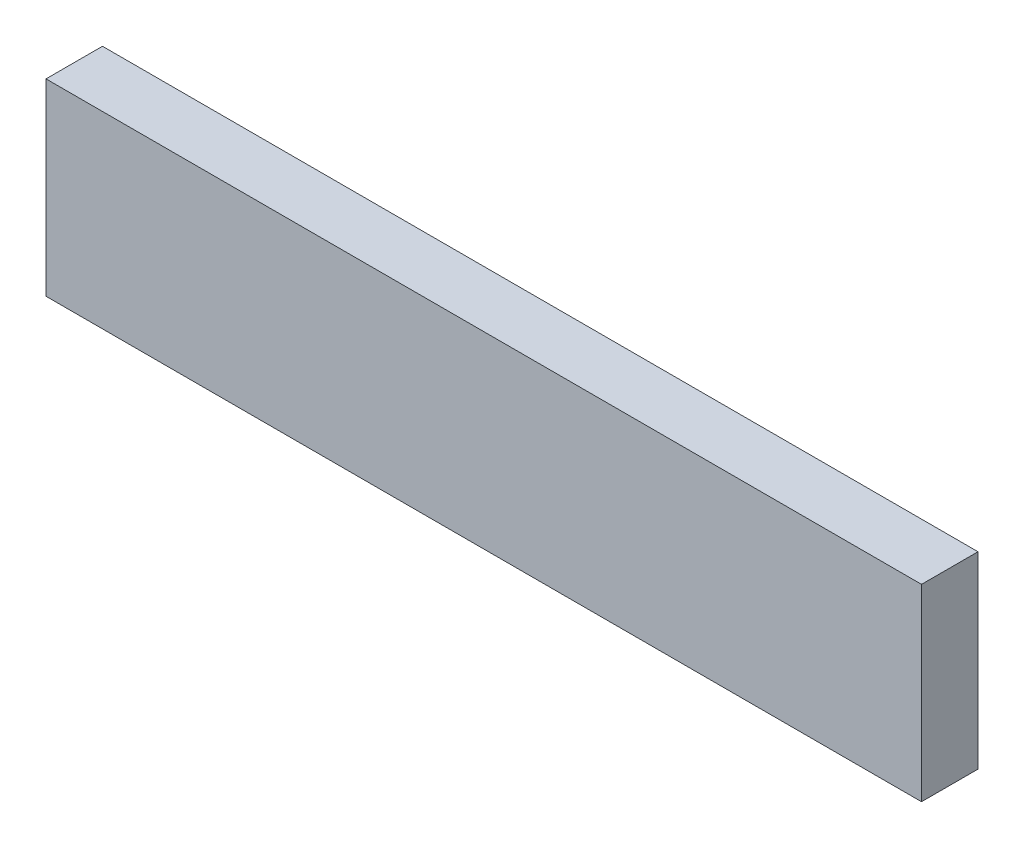
ISO-10303-21;
HEADER;
FILE_DESCRIPTION(('STEP AP214'),'2;1');
FILE_NAME('part.step','',(''),(''),'','','');
FILE_SCHEMA(('AUTOMOTIVE_DESIGN { 1 0 10303 214 1 1 1 1 }'));
ENDSEC;
DATA;
#1=APPLICATION_CONTEXT('core data for automotive mechanical design processes');
#2=APPLICATION_PROTOCOL_DEFINITION('international standard','automotive_design',2000,#1);
#3=PRODUCT_CONTEXT('',#1,'mechanical');
#4=PRODUCT('Part','Part','',(#3));
#5=PRODUCT_RELATED_PRODUCT_CATEGORY('part','',(#4));
#6=PRODUCT_DEFINITION_FORMATION('','',#4);
#7=PRODUCT_DEFINITION_CONTEXT('part definition',#1,'design');
#8=PRODUCT_DEFINITION('design','',#6,#7);
#9=PRODUCT_DEFINITION_SHAPE('','',#8);
#10=(LENGTH_UNIT() NAMED_UNIT(*) SI_UNIT(.MILLI.,.METRE.));
#11=(NAMED_UNIT(*) PLANE_ANGLE_UNIT() SI_UNIT($,.RADIAN.));
#12=(NAMED_UNIT(*) SI_UNIT($,.STERADIAN.) SOLID_ANGLE_UNIT());
#13=UNCERTAINTY_MEASURE_WITH_UNIT(LENGTH_MEASURE(1.E-05),#10,'distance_accuracy_value','');
#14=(GEOMETRIC_REPRESENTATION_CONTEXT(3) GLOBAL_UNCERTAINTY_ASSIGNED_CONTEXT((#13)) GLOBAL_UNIT_ASSIGNED_CONTEXT((#10,
#11,#12)) REPRESENTATION_CONTEXT('',''));
#15=CARTESIAN_POINT('',(0.,0.,0.));
#16=DIRECTION('',(0.,0.,1.));
#17=DIRECTION('',(1.,0.,0.));
#18=AXIS2_PLACEMENT_3D('',#15,#16,#17);
#19=CARTESIAN_POINT('',(295.275,-31.75,-9.525));
#20=DIRECTION('',(0.,0.,1.));
#21=DIRECTION('',(1.,0.,0.));
#22=AXIS2_PLACEMENT_3D('',#19,#20,#21);
#23=PLANE('',#22);
#24=DIRECTION('',(0.,1.,0.));
#25=VECTOR('',#24,1.);
#26=CARTESIAN_POINT('',(0.,-31.75,-9.525));
#27=LINE('',#26,#25);
#28=CARTESIAN_POINT('',(0.,-31.75,-9.525));
#29=VERTEX_POINT('',#28);
#30=CARTESIAN_POINT('',(0.,31.75,-9.525));
#31=VERTEX_POINT('',#30);
#32=EDGE_CURVE('E95',#29,#31,#27,.T.);
#33=ORIENTED_EDGE('',*,*,#32,.T.);
#34=DIRECTION('',(-1.,0.,0.));
#35=VECTOR('',#34,1.);
#36=CARTESIAN_POINT('',(295.275,31.75,-9.525));
#37=LINE('',#36,#35);
#38=CARTESIAN_POINT('',(295.275,31.75,-9.525));
#39=VERTEX_POINT('',#38);
#40=EDGE_CURVE('E11',#39,#31,#37,.T.);
#41=ORIENTED_EDGE('',*,*,#40,.F.);
#42=DIRECTION('',(0.,1.,0.));
#43=VECTOR('',#42,1.);
#44=CARTESIAN_POINT('',(295.275,-31.75,-9.525));
#45=LINE('',#44,#43);
#46=CARTESIAN_POINT('',(295.275,-31.75,-9.525));
#47=VERTEX_POINT('',#46);
#48=EDGE_CURVE('E83',#47,#39,#45,.T.);
#49=ORIENTED_EDGE('',*,*,#48,.F.);
#50=DIRECTION('',(-1.,0.,0.));
#51=VECTOR('',#50,1.);
#52=CARTESIAN_POINT('',(295.275,-31.75,-9.525));
#53=LINE('',#52,#51);
#54=EDGE_CURVE('E91',#47,#29,#53,.T.);
#55=ORIENTED_EDGE('',*,*,#54,.T.);
#56=EDGE_LOOP('',(#33,#41,#49,#55));
#57=FACE_BOUND('',#56,.T.);
#58=ADVANCED_FACE('F32',(#57),#23,.F.);
#59=CARTESIAN_POINT('',(295.275,31.75,9.525));
#60=DIRECTION('',(0.,-1.,0.));
#61=DIRECTION('',(0.,0.,-1.));
#62=AXIS2_PLACEMENT_3D('',#59,#60,#61);
#63=PLANE('',#62);
#64=DIRECTION('',(0.,0.,1.));
#65=VECTOR('',#64,1.);
#66=CARTESIAN_POINT('',(0.,31.75,9.525));
#67=LINE('',#66,#65);
#68=CARTESIAN_POINT('',(0.,31.75,9.525));
#69=VERTEX_POINT('',#68);
#70=EDGE_CURVE('E87',#31,#69,#67,.T.);
#71=ORIENTED_EDGE('',*,*,#70,.T.);
#72=DIRECTION('',(-1.,0.,0.));
#73=VECTOR('',#72,1.);
#74=CARTESIAN_POINT('',(295.275,31.75,9.525));
#75=LINE('',#74,#73);
#76=CARTESIAN_POINT('',(295.275,31.75,9.525));
#77=VERTEX_POINT('',#76);
#78=EDGE_CURVE('E40',#77,#69,#75,.T.);
#79=ORIENTED_EDGE('',*,*,#78,.F.);
#80=DIRECTION('',(0.,0.,1.));
#81=VECTOR('',#80,1.);
#82=CARTESIAN_POINT('',(295.275,31.75,9.525));
#83=LINE('',#82,#81);
#84=EDGE_CURVE('E78',#39,#77,#83,.T.);
#85=ORIENTED_EDGE('',*,*,#84,.F.);
#86=ORIENTED_EDGE('',*,*,#40,.T.);
#87=EDGE_LOOP('',(#71,#79,#85,#86));
#88=FACE_BOUND('',#87,.T.);
#89=ADVANCED_FACE('F86',(#88),#63,.F.);
#90=CARTESIAN_POINT('',(295.275,-31.75,9.525));
#91=DIRECTION('',(0.,0.,-1.));
#92=DIRECTION('',(-1.,0.,0.));
#93=AXIS2_PLACEMENT_3D('',#90,#91,#92);
#94=PLANE('',#93);
#95=DIRECTION('',(0.,-1.,0.));
#96=VECTOR('',#95,1.);
#97=CARTESIAN_POINT('',(0.,-31.75,9.525));
#98=LINE('',#97,#96);
#99=CARTESIAN_POINT('',(0.,-31.75,9.525));
#100=VERTEX_POINT('',#99);
#101=EDGE_CURVE('E65',#69,#100,#98,.T.);
#102=ORIENTED_EDGE('',*,*,#101,.T.);
#103=DIRECTION('',(-1.,0.,0.));
#104=VECTOR('',#103,1.);
#105=CARTESIAN_POINT('',(295.275,-31.75,9.525));
#106=LINE('',#105,#104);
#107=CARTESIAN_POINT('',(295.275,-31.75,9.525));
#108=VERTEX_POINT('',#107);
#109=EDGE_CURVE('E88',#108,#100,#106,.T.);
#110=ORIENTED_EDGE('',*,*,#109,.F.);
#111=DIRECTION('',(0.,-1.,0.));
#112=VECTOR('',#111,1.);
#113=CARTESIAN_POINT('',(295.275,-31.75,9.525));
#114=LINE('',#113,#112);
#115=EDGE_CURVE('E81',#77,#108,#114,.T.);
#116=ORIENTED_EDGE('',*,*,#115,.F.);
#117=ORIENTED_EDGE('',*,*,#78,.T.);
#118=EDGE_LOOP('',(#102,#110,#116,#117));
#119=FACE_BOUND('',#118,.T.);
#120=ADVANCED_FACE('F89',(#119),#94,.F.);
#121=CARTESIAN_POINT('',(295.275,-31.75,9.525));
#122=DIRECTION('',(0.,1.,0.));
#123=DIRECTION('',(0.,0.,1.));
#124=AXIS2_PLACEMENT_3D('',#121,#122,#123);
#125=PLANE('',#124);
#126=DIRECTION('',(0.,0.,-1.));
#127=VECTOR('',#126,1.);
#128=CARTESIAN_POINT('',(0.,-31.75,9.525));
#129=LINE('',#128,#127);
#130=EDGE_CURVE('E71',#100,#29,#129,.T.);
#131=ORIENTED_EDGE('',*,*,#130,.T.);
#132=ORIENTED_EDGE('',*,*,#54,.F.);
#133=DIRECTION('',(0.,0.,-1.));
#134=VECTOR('',#133,1.);
#135=CARTESIAN_POINT('',(295.275,-31.75,9.525));
#136=LINE('',#135,#134);
#137=EDGE_CURVE('E48',#108,#47,#136,.T.);
#138=ORIENTED_EDGE('',*,*,#137,.F.);
#139=ORIENTED_EDGE('',*,*,#109,.T.);
#140=EDGE_LOOP('',(#131,#132,#138,#139));
#141=FACE_BOUND('',#140,.T.);
#142=ADVANCED_FACE('F102',(#141),#125,.F.);
#143=CARTESIAN_POINT('',(295.275,0.,0.));
#144=DIRECTION('',(-1.,0.,0.));
#145=DIRECTION('',(0.,0.,1.));
#146=AXIS2_PLACEMENT_3D('',#143,#144,#145);
#147=PLANE('',#146);
#148=ORIENTED_EDGE('',*,*,#48,.T.);
#149=ORIENTED_EDGE('',*,*,#84,.T.);
#150=ORIENTED_EDGE('',*,*,#115,.T.);
#151=ORIENTED_EDGE('',*,*,#137,.T.);
#152=EDGE_LOOP('',(#148,#149,#150,#151));
#153=FACE_BOUND('',#152,.T.);
#154=ADVANCED_FACE('F79',(#153),#147,.F.);
#155=CARTESIAN_POINT('',(0.,0.,0.));
#156=DIRECTION('',(-1.,0.,0.));
#157=DIRECTION('',(0.,0.,1.));
#158=AXIS2_PLACEMENT_3D('',#155,#156,#157);
#159=PLANE('',#158);
#160=ORIENTED_EDGE('',*,*,#32,.F.);
#161=ORIENTED_EDGE('',*,*,#130,.F.);
#162=ORIENTED_EDGE('',*,*,#101,.F.);
#163=ORIENTED_EDGE('',*,*,#70,.F.);
#164=EDGE_LOOP('',(#160,#161,#162,#163));
#165=FACE_BOUND('',#164,.T.);
#166=ADVANCED_FACE('F105',(#165),#159,.T.);
#167=CLOSED_SHELL('',(#58,#89,#120,#142,#154,#166));
#168=MANIFOLD_SOLID_BREP('B2',#167);
#169=ADVANCED_BREP_SHAPE_REPRESENTATION('',(#18,#168),#14);
#170=SHAPE_DEFINITION_REPRESENTATION(#9,#169);
ENDSEC;
END-ISO-10303-21;
